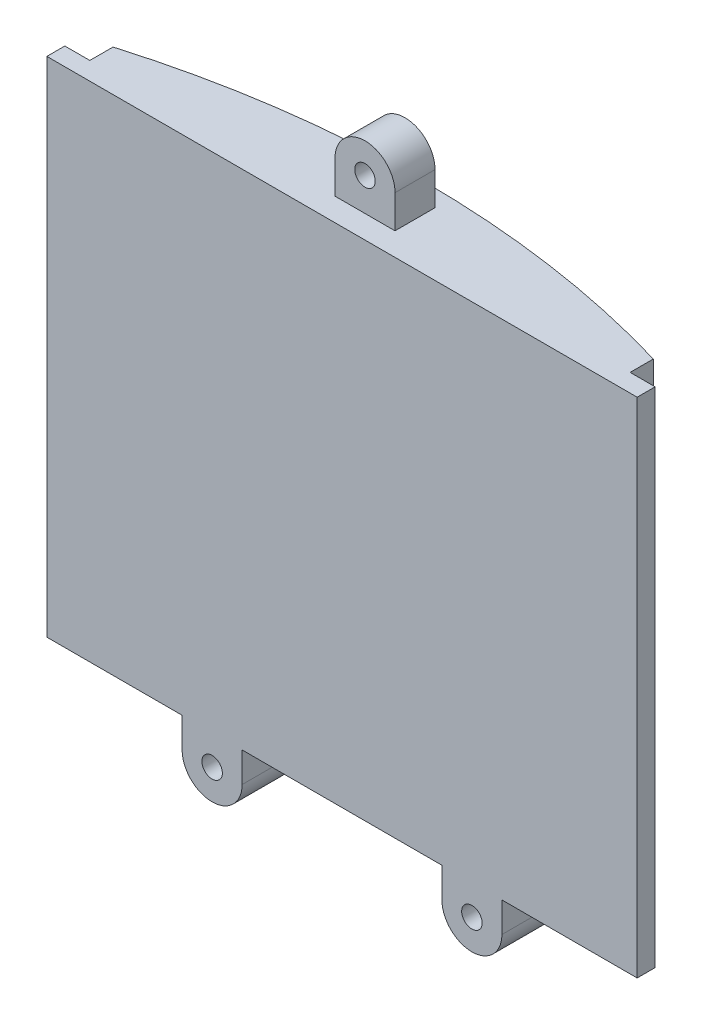
ISO-10303-21;
HEADER;
FILE_DESCRIPTION(('STEP AP214'),'2;1');
FILE_NAME('part.step','',(''),(''),'','','');
FILE_SCHEMA(('AUTOMOTIVE_DESIGN { 1 0 10303 214 1 1 1 1 }'));
ENDSEC;
DATA;
#1=APPLICATION_CONTEXT('core data for automotive mechanical design processes');
#2=APPLICATION_PROTOCOL_DEFINITION('international standard','automotive_design',2000,#1);
#3=PRODUCT_CONTEXT('',#1,'mechanical');
#4=PRODUCT('Part','Part','',(#3));
#5=PRODUCT_RELATED_PRODUCT_CATEGORY('part','',(#4));
#6=PRODUCT_DEFINITION_FORMATION('','',#4);
#7=PRODUCT_DEFINITION_CONTEXT('part definition',#1,'design');
#8=PRODUCT_DEFINITION('design','',#6,#7);
#9=PRODUCT_DEFINITION_SHAPE('','',#8);
#10=(LENGTH_UNIT() NAMED_UNIT(*) SI_UNIT(.MILLI.,.METRE.));
#11=(NAMED_UNIT(*) PLANE_ANGLE_UNIT() SI_UNIT($,.RADIAN.));
#12=(NAMED_UNIT(*) SI_UNIT($,.STERADIAN.) SOLID_ANGLE_UNIT());
#13=UNCERTAINTY_MEASURE_WITH_UNIT(LENGTH_MEASURE(1.E-05),#10,'distance_accuracy_value','');
#14=(GEOMETRIC_REPRESENTATION_CONTEXT(3) GLOBAL_UNCERTAINTY_ASSIGNED_CONTEXT((#13)) GLOBAL_UNIT_ASSIGNED_CONTEXT((#10,
#11,#12)) REPRESENTATION_CONTEXT('',''));
#15=CARTESIAN_POINT('',(0.,0.,0.));
#16=DIRECTION('',(0.,0.,1.));
#17=DIRECTION('',(1.,0.,0.));
#18=AXIS2_PLACEMENT_3D('',#15,#16,#17);
#19=CARTESIAN_POINT('',(0.,-40.9446130729417,50.1876320685335));
#20=DIRECTION('',(0.,-1.,0.));
#21=DIRECTION('',(0.,0.,-1.));
#22=AXIS2_PLACEMENT_3D('',#19,#20,#21);
#23=PLANE('',#22);
#24=DIRECTION('',(-1.,0.,0.));
#25=VECTOR('',#24,1.);
#26=CARTESIAN_POINT('',(-29.5149761749015,-40.9446130729417,-37.4));
#27=LINE('',#26,#25);
#28=CARTESIAN_POINT('',(29.5149761749015,-40.9446130729417,-37.4));
#29=VERTEX_POINT('',#28);
#30=CARTESIAN_POINT('',(15.9891024077721,-40.9446130729417,-37.4));
#31=VERTEX_POINT('',#30);
#32=EDGE_CURVE('E285',#29,#31,#27,.T.);
#33=ORIENTED_EDGE('',*,*,#32,.T.);
#34=DIRECTION('',(0.,0.,1.));
#35=VECTOR('',#34,1.);
#36=CARTESIAN_POINT('',(15.9891024077721,-40.9446130729417,-42.3));
#37=LINE('',#36,#35);
#38=CARTESIAN_POINT('',(15.9891024077721,-40.9446130729417,-42.3));
#39=VERTEX_POINT('',#38);
#40=EDGE_CURVE('E69',#39,#31,#37,.T.);
#41=ORIENTED_EDGE('',*,*,#40,.F.);
#42=DIRECTION('',(-1.,0.,0.));
#43=VECTOR('',#42,1.);
#44=CARTESIAN_POINT('',(0.,-40.9446130729418,-42.3));
#45=LINE('',#44,#43);
#46=CARTESIAN_POINT('',(9.98910240777212,-40.9446130729417,-42.3));
#47=VERTEX_POINT('',#46);
#48=EDGE_CURVE('E224',#39,#47,#45,.T.);
#49=ORIENTED_EDGE('',*,*,#48,.T.);
#50=DIRECTION('',(0.,0.,1.));
#51=VECTOR('',#50,1.);
#52=CARTESIAN_POINT('',(9.98910240777212,-40.9446130729417,-42.3));
#53=LINE('',#52,#51);
#54=CARTESIAN_POINT('',(9.98910240777212,-40.9446130729417,-37.4));
#55=VERTEX_POINT('',#54);
#56=EDGE_CURVE('E216',#47,#55,#53,.T.);
#57=ORIENTED_EDGE('',*,*,#56,.T.);
#58=CARTESIAN_POINT('',(-9.98910240777212,-40.9446130729417,-37.4));
#59=VERTEX_POINT('',#58);
#60=EDGE_CURVE('E287',#55,#59,#27,.T.);
#61=ORIENTED_EDGE('',*,*,#60,.T.);
#62=DIRECTION('',(0.,0.,1.));
#63=VECTOR('',#62,1.);
#64=CARTESIAN_POINT('',(-9.98910240777212,-40.9446130729417,-42.3));
#65=LINE('',#64,#63);
#66=CARTESIAN_POINT('',(-9.98910240777212,-40.9446130729417,-42.3));
#67=VERTEX_POINT('',#66);
#68=EDGE_CURVE('E259',#67,#59,#65,.T.);
#69=ORIENTED_EDGE('',*,*,#68,.F.);
#70=DIRECTION('',(-1.,0.,0.));
#71=VECTOR('',#70,1.);
#72=CARTESIAN_POINT('',(0.,-40.9446130729417,-42.3));
#73=LINE('',#72,#71);
#74=CARTESIAN_POINT('',(-15.9891024077721,-40.9446130729417,-42.3));
#75=VERTEX_POINT('',#74);
#76=EDGE_CURVE('E236',#67,#75,#73,.T.);
#77=ORIENTED_EDGE('',*,*,#76,.T.);
#78=DIRECTION('',(0.,0.,1.));
#79=VECTOR('',#78,1.);
#80=CARTESIAN_POINT('',(-15.9891024077721,-40.9446130729417,-42.3));
#81=LINE('',#80,#79);
#82=CARTESIAN_POINT('',(-15.9891024077721,-40.9446130729417,-37.4));
#83=VERTEX_POINT('',#82);
#84=EDGE_CURVE('E246',#75,#83,#81,.T.);
#85=ORIENTED_EDGE('',*,*,#84,.T.);
#86=CARTESIAN_POINT('',(-29.5149761749015,-40.9446130729417,-37.4));
#87=VERTEX_POINT('',#86);
#88=EDGE_CURVE('E262',#83,#87,#27,.T.);
#89=ORIENTED_EDGE('',*,*,#88,.T.);
#90=DIRECTION('',(0.,0.,-1.));
#91=VECTOR('',#90,1.);
#92=CARTESIAN_POINT('',(-29.5149761749015,-40.9446130729417,-37.4));
#93=LINE('',#92,#91);
#94=CARTESIAN_POINT('',(-29.5149761749015,-40.9446130729417,-39.1966199322564));
#95=VERTEX_POINT('',#94);
#96=EDGE_CURVE('E282',#87,#95,#93,.T.);
#97=ORIENTED_EDGE('',*,*,#96,.T.);
#98=DIRECTION('',(1.,0.,0.));
#99=VECTOR('',#98,1.);
#100=CARTESIAN_POINT('',(-29.5149761749015,-40.9446130729417,-39.1966199322564));
#101=LINE('',#100,#99);
#102=CARTESIAN_POINT('',(-27.0149761749015,-40.9446130729417,-39.1966199322564));
#103=VERTEX_POINT('',#102);
#104=EDGE_CURVE('E279',#95,#103,#101,.T.);
#105=ORIENTED_EDGE('',*,*,#104,.T.);
#106=DIRECTION('',(0.,0.,-1.));
#107=VECTOR('',#106,1.);
#108=CARTESIAN_POINT('',(-27.0149761749015,-40.9446130729417,-39.1966199322564));
#109=LINE('',#108,#107);
#110=CARTESIAN_POINT('',(-27.0149761749015,-40.9446130729417,-41.5179745823137));
#111=VERTEX_POINT('',#110);
#112=EDGE_CURVE('E276',#103,#111,#109,.T.);
#113=ORIENTED_EDGE('',*,*,#112,.T.);
#114=CARTESIAN_POINT('',(0.,-40.9446130729417,50.1876320685335));
#115=DIRECTION('',(0.,-1.,0.));
#116=DIRECTION('',(0.,0.,-1.));
#117=AXIS2_PLACEMENT_3D('',#114,#115,#116);
#118=CIRCLE('',#117,95.6019206341086);
#119=CARTESIAN_POINT('',(27.0149761749016,-40.9446130729417,-41.5179745823136));
#120=VERTEX_POINT('',#119);
#121=EDGE_CURVE('E273',#111,#120,#118,.T.);
#122=ORIENTED_EDGE('',*,*,#121,.T.);
#123=DIRECTION('',(0.,0.,1.));
#124=VECTOR('',#123,1.);
#125=CARTESIAN_POINT('',(27.0149761749015,-40.9446130729417,-39.1966199322563));
#126=LINE('',#125,#124);
#127=CARTESIAN_POINT('',(27.0149761749015,-40.9446130729417,-39.1966199322563));
#128=VERTEX_POINT('',#127);
#129=EDGE_CURVE('E270',#120,#128,#126,.T.);
#130=ORIENTED_EDGE('',*,*,#129,.T.);
#131=DIRECTION('',(1.,0.,0.));
#132=VECTOR('',#131,1.);
#133=CARTESIAN_POINT('',(29.5149761749015,-40.9446130729417,-39.1966199322563));
#134=LINE('',#133,#132);
#135=CARTESIAN_POINT('',(29.5149761749015,-40.9446130729417,-39.1966199322563));
#136=VERTEX_POINT('',#135);
#137=EDGE_CURVE('E267',#128,#136,#134,.T.);
#138=ORIENTED_EDGE('',*,*,#137,.T.);
#139=DIRECTION('',(0.,0.,1.));
#140=VECTOR('',#139,1.);
#141=CARTESIAN_POINT('',(29.5149761749015,-40.9446130729417,-37.4));
#142=LINE('',#141,#140);
#143=EDGE_CURVE('E263',#136,#29,#142,.T.);
#144=ORIENTED_EDGE('',*,*,#143,.T.);
#145=EDGE_LOOP('',(#33,#41,#49,#57,#61,#69,#77,#85,#89,#97,#105,#113,#122,#130,#138,#144));
#146=FACE_BOUND('',#145,.T.);
#147=ADVANCED_FACE('F44',(#146),#23,.T.);
#148=CARTESIAN_POINT('',(0.,9.35538692705828,-27.));
#149=DIRECTION('',(0.,1.,0.));
#150=DIRECTION('',(0.,0.,1.));
#151=AXIS2_PLACEMENT_3D('',#148,#149,#150);
#152=PLANE('',#151);
#153=DIRECTION('',(-1.,0.,0.));
#154=VECTOR('',#153,1.);
#155=CARTESIAN_POINT('',(0.,9.35538692705828,-43.7));
#156=LINE('',#155,#154);
#157=CARTESIAN_POINT('',(3.,9.35538692705828,-43.7));
#158=VERTEX_POINT('',#157);
#159=CARTESIAN_POINT('',(-3.,9.35538692705828,-43.7));
#160=VERTEX_POINT('',#159);
#161=EDGE_CURVE('E11',#158,#160,#156,.T.);
#162=ORIENTED_EDGE('',*,*,#161,.F.);
#163=DIRECTION('',(0.,0.,1.));
#164=VECTOR('',#163,1.);
#165=CARTESIAN_POINT('',(3.,9.35538692705828,-27.));
#166=LINE('',#165,#164);
#167=CARTESIAN_POINT('',(3.,9.35538692705828,-39.7));
#168=VERTEX_POINT('',#167);
#169=EDGE_CURVE('E53',#158,#168,#166,.T.);
#170=ORIENTED_EDGE('',*,*,#169,.T.);
#171=DIRECTION('',(-1.,0.,0.));
#172=VECTOR('',#171,1.);
#173=CARTESIAN_POINT('',(0.,9.35538692705828,-39.7));
#174=LINE('',#173,#172);
#175=CARTESIAN_POINT('',(-3.,9.35538692705828,-39.7));
#176=VERTEX_POINT('',#175);
#177=EDGE_CURVE('E328',#168,#176,#174,.T.);
#178=ORIENTED_EDGE('',*,*,#177,.T.);
#179=DIRECTION('',(0.,0.,-1.));
#180=VECTOR('',#179,1.);
#181=CARTESIAN_POINT('',(-3.,9.35538692705828,-27.));
#182=LINE('',#181,#180);
#183=EDGE_CURVE('E331',#176,#160,#182,.T.);
#184=ORIENTED_EDGE('',*,*,#183,.T.);
#185=EDGE_LOOP('',(#162,#170,#178,#184));
#186=FACE_BOUND('',#185,.T.);
#187=DIRECTION('',(-1.,0.,0.));
#188=VECTOR('',#187,1.);
#189=CARTESIAN_POINT('',(-29.5149761749015,9.35538692705828,-37.4));
#190=LINE('',#189,#188);
#191=CARTESIAN_POINT('',(29.5149761749015,9.35538692705828,-37.4));
#192=VERTEX_POINT('',#191);
#193=CARTESIAN_POINT('',(-29.5149761749015,9.35538692705828,-37.4));
#194=VERTEX_POINT('',#193);
#195=EDGE_CURVE('E291',#192,#194,#190,.T.);
#196=ORIENTED_EDGE('',*,*,#195,.F.);
#197=DIRECTION('',(0.,0.,1.));
#198=VECTOR('',#197,1.);
#199=CARTESIAN_POINT('',(29.5149761749015,9.35538692705828,-37.4));
#200=LINE('',#199,#198);
#201=CARTESIAN_POINT('',(29.5149761749015,9.35538692705828,-39.1966199322563));
#202=VERTEX_POINT('',#201);
#203=EDGE_CURVE('E296',#202,#192,#200,.T.);
#204=ORIENTED_EDGE('',*,*,#203,.F.);
#205=DIRECTION('',(1.,0.,0.));
#206=VECTOR('',#205,1.);
#207=CARTESIAN_POINT('',(29.5149761749015,9.35538692705828,-39.1966199322563));
#208=LINE('',#207,#206);
#209=CARTESIAN_POINT('',(27.0149761749015,9.35538692705828,-39.1966199322563));
#210=VERTEX_POINT('',#209);
#211=EDGE_CURVE('E300',#210,#202,#208,.T.);
#212=ORIENTED_EDGE('',*,*,#211,.F.);
#213=DIRECTION('',(0.,0.,1.));
#214=VECTOR('',#213,1.);
#215=CARTESIAN_POINT('',(27.0149761749015,9.35538692705828,-39.1966199322563));
#216=LINE('',#215,#214);
#217=CARTESIAN_POINT('',(27.0149761749016,9.35538692705828,-41.5179745823136));
#218=VERTEX_POINT('',#217);
#219=EDGE_CURVE('E304',#218,#210,#216,.T.);
#220=ORIENTED_EDGE('',*,*,#219,.F.);
#221=CARTESIAN_POINT('',(0.,9.35538692705828,50.1876320685335));
#222=DIRECTION('',(0.,1.,0.));
#223=DIRECTION('',(0.,0.,1.));
#224=AXIS2_PLACEMENT_3D('',#221,#222,#223);
#225=CIRCLE('',#224,95.6019206341086);
#226=CARTESIAN_POINT('',(-27.0149761749015,9.35538692705828,-41.5179745823137));
#227=VERTEX_POINT('',#226);
#228=EDGE_CURVE('E308',#227,#218,#225,.F.);
#229=ORIENTED_EDGE('',*,*,#228,.F.);
#230=DIRECTION('',(0.,0.,-1.));
#231=VECTOR('',#230,1.);
#232=CARTESIAN_POINT('',(-27.0149761749015,9.35538692705828,-39.1966199322564));
#233=LINE('',#232,#231);
#234=CARTESIAN_POINT('',(-27.0149761749015,9.35538692705828,-39.1966199322564));
#235=VERTEX_POINT('',#234);
#236=EDGE_CURVE('E312',#235,#227,#233,.T.);
#237=ORIENTED_EDGE('',*,*,#236,.F.);
#238=DIRECTION('',(1.,0.,0.));
#239=VECTOR('',#238,1.);
#240=CARTESIAN_POINT('',(-29.5149761749015,9.35538692705828,-39.1966199322564));
#241=LINE('',#240,#239);
#242=CARTESIAN_POINT('',(-29.5149761749015,9.35538692705828,-39.1966199322564));
#243=VERTEX_POINT('',#242);
#244=EDGE_CURVE('E316',#243,#235,#241,.T.);
#245=ORIENTED_EDGE('',*,*,#244,.F.);
#246=DIRECTION('',(0.,0.,-1.));
#247=VECTOR('',#246,1.);
#248=CARTESIAN_POINT('',(-29.5149761749015,9.35538692705828,-37.4));
#249=LINE('',#248,#247);
#250=EDGE_CURVE('E266',#194,#243,#249,.T.);
#251=ORIENTED_EDGE('',*,*,#250,.F.);
#252=EDGE_LOOP('',(#196,#204,#212,#220,#229,#237,#245,#251));
#253=FACE_BOUND('',#252,.T.);
#254=ADVANCED_FACE('F46',(#186,#253),#152,.T.);
#255=CARTESIAN_POINT('',(-29.5149761749015,69.2268909842191,-37.4));
#256=DIRECTION('',(-1.,0.,0.));
#257=DIRECTION('',(0.,0.,1.));
#258=AXIS2_PLACEMENT_3D('',#255,#256,#257);
#259=PLANE('',#258);
#260=DIRECTION('',(0.,-1.,0.));
#261=VECTOR('',#260,1.);
#262=CARTESIAN_POINT('',(-29.5149761749015,69.2268909842191,-37.4));
#263=LINE('',#262,#261);
#264=EDGE_CURVE('E294',#194,#87,#263,.T.);
#265=ORIENTED_EDGE('',*,*,#264,.F.);
#266=ORIENTED_EDGE('',*,*,#250,.T.);
#267=DIRECTION('',(0.,-1.,0.));
#268=VECTOR('',#267,1.);
#269=CARTESIAN_POINT('',(-29.5149761749015,69.2268909842191,-39.1966199322564));
#270=LINE('',#269,#268);
#271=EDGE_CURVE('E290',#243,#95,#270,.T.);
#272=ORIENTED_EDGE('',*,*,#271,.T.);
#273=ORIENTED_EDGE('',*,*,#96,.F.);
#274=EDGE_LOOP('',(#265,#266,#272,#273));
#275=FACE_BOUND('',#274,.T.);
#276=ADVANCED_FACE('F380',(#275),#259,.T.);
#277=CARTESIAN_POINT('',(-29.5149761749015,69.2268909842191,-39.1966199322564));
#278=DIRECTION('',(0.,0.,-1.));
#279=DIRECTION('',(-1.,0.,0.));
#280=AXIS2_PLACEMENT_3D('',#277,#278,#279);
#281=PLANE('',#280);
#282=ORIENTED_EDGE('',*,*,#271,.F.);
#283=ORIENTED_EDGE('',*,*,#244,.T.);
#284=DIRECTION('',(0.,-1.,0.));
#285=VECTOR('',#284,1.);
#286=CARTESIAN_POINT('',(-27.0149761749015,69.2268909842191,-39.1966199322564));
#287=LINE('',#286,#285);
#288=EDGE_CURVE('E315',#235,#103,#287,.T.);
#289=ORIENTED_EDGE('',*,*,#288,.T.);
#290=ORIENTED_EDGE('',*,*,#104,.F.);
#291=EDGE_LOOP('',(#282,#283,#289,#290));
#292=FACE_BOUND('',#291,.T.);
#293=ADVANCED_FACE('F410',(#292),#281,.T.);
#294=CARTESIAN_POINT('',(-27.0149761749015,69.2268909842191,-39.1966199322564));
#295=DIRECTION('',(-1.,0.,0.));
#296=DIRECTION('',(0.,0.,1.));
#297=AXIS2_PLACEMENT_3D('',#294,#295,#296);
#298=PLANE('',#297);
#299=ORIENTED_EDGE('',*,*,#288,.F.);
#300=ORIENTED_EDGE('',*,*,#236,.T.);
#301=DIRECTION('',(0.,-1.,0.));
#302=VECTOR('',#301,1.);
#303=CARTESIAN_POINT('',(-27.0149761749015,69.2268909842191,-41.5179745823137));
#304=LINE('',#303,#302);
#305=EDGE_CURVE('E311',#227,#111,#304,.T.);
#306=ORIENTED_EDGE('',*,*,#305,.T.);
#307=ORIENTED_EDGE('',*,*,#112,.F.);
#308=EDGE_LOOP('',(#299,#300,#306,#307));
#309=FACE_BOUND('',#308,.T.);
#310=ADVANCED_FACE('F406',(#309),#298,.T.);
#311=CARTESIAN_POINT('',(0.,69.2268909842191,50.1876320685335));
#312=DIRECTION('',(0.,-1.,0.));
#313=DIRECTION('',(0.,0.,-1.));
#314=AXIS2_PLACEMENT_3D('',#311,#312,#313);
#315=CYLINDRICAL_SURFACE('',#314,95.6019206341086);
#316=ORIENTED_EDGE('',*,*,#305,.F.);
#317=ORIENTED_EDGE('',*,*,#228,.T.);
#318=DIRECTION('',(0.,-1.,0.));
#319=VECTOR('',#318,1.);
#320=CARTESIAN_POINT('',(27.0149761749016,69.2268909842191,-41.5179745823136));
#321=LINE('',#320,#319);
#322=EDGE_CURVE('E307',#218,#120,#321,.T.);
#323=ORIENTED_EDGE('',*,*,#322,.T.);
#324=ORIENTED_EDGE('',*,*,#121,.F.);
#325=EDGE_LOOP('',(#316,#317,#323,#324));
#326=FACE_BOUND('',#325,.T.);
#327=ADVANCED_FACE('F402',(#326),#315,.T.);
#328=CARTESIAN_POINT('',(27.0149761749015,69.2268909842191,-39.1966199322563));
#329=DIRECTION('',(1.,0.,0.));
#330=DIRECTION('',(0.,0.,-1.));
#331=AXIS2_PLACEMENT_3D('',#328,#329,#330);
#332=PLANE('',#331);
#333=ORIENTED_EDGE('',*,*,#322,.F.);
#334=ORIENTED_EDGE('',*,*,#219,.T.);
#335=DIRECTION('',(0.,-1.,0.));
#336=VECTOR('',#335,1.);
#337=CARTESIAN_POINT('',(27.0149761749015,69.2268909842191,-39.1966199322563));
#338=LINE('',#337,#336);
#339=EDGE_CURVE('E303',#210,#128,#338,.T.);
#340=ORIENTED_EDGE('',*,*,#339,.T.);
#341=ORIENTED_EDGE('',*,*,#129,.F.);
#342=EDGE_LOOP('',(#333,#334,#340,#341));
#343=FACE_BOUND('',#342,.T.);
#344=ADVANCED_FACE('F399',(#343),#332,.T.);
#345=CARTESIAN_POINT('',(29.5149761749015,69.2268909842191,-39.1966199322563));
#346=DIRECTION('',(0.,0.,-1.));
#347=DIRECTION('',(-1.,0.,0.));
#348=AXIS2_PLACEMENT_3D('',#345,#346,#347);
#349=PLANE('',#348);
#350=ORIENTED_EDGE('',*,*,#339,.F.);
#351=ORIENTED_EDGE('',*,*,#211,.T.);
#352=DIRECTION('',(0.,-1.,0.));
#353=VECTOR('',#352,1.);
#354=CARTESIAN_POINT('',(29.5149761749015,69.2268909842191,-39.1966199322563));
#355=LINE('',#354,#353);
#356=EDGE_CURVE('E299',#202,#136,#355,.T.);
#357=ORIENTED_EDGE('',*,*,#356,.T.);
#358=ORIENTED_EDGE('',*,*,#137,.F.);
#359=EDGE_LOOP('',(#350,#351,#357,#358));
#360=FACE_BOUND('',#359,.T.);
#361=ADVANCED_FACE('F394',(#360),#349,.T.);
#362=CARTESIAN_POINT('',(29.5149761749015,69.2268909842191,-37.4));
#363=DIRECTION('',(1.,0.,0.));
#364=DIRECTION('',(0.,0.,-1.));
#365=AXIS2_PLACEMENT_3D('',#362,#363,#364);
#366=PLANE('',#365);
#367=ORIENTED_EDGE('',*,*,#356,.F.);
#368=ORIENTED_EDGE('',*,*,#203,.T.);
#369=DIRECTION('',(0.,-1.,0.));
#370=VECTOR('',#369,1.);
#371=CARTESIAN_POINT('',(29.5149761749015,69.2268909842191,-37.4));
#372=LINE('',#371,#370);
#373=EDGE_CURVE('E295',#192,#29,#372,.T.);
#374=ORIENTED_EDGE('',*,*,#373,.T.);
#375=ORIENTED_EDGE('',*,*,#143,.F.);
#376=EDGE_LOOP('',(#367,#368,#374,#375));
#377=FACE_BOUND('',#376,.T.);
#378=ADVANCED_FACE('F390',(#377),#366,.T.);
#379=CARTESIAN_POINT('',(-29.5149761749015,69.2268909842191,-37.4));
#380=DIRECTION('',(0.,0.,1.));
#381=DIRECTION('',(1.,0.,0.));
#382=AXIS2_PLACEMENT_3D('',#379,#380,#381);
#383=PLANE('',#382);
#384=CARTESIAN_POINT('',(-12.9891024077721,-43.9446130729417,-37.4));
#385=DIRECTION('',(0.,0.,1.));
#386=DIRECTION('',(1.,0.,0.));
#387=AXIS2_PLACEMENT_3D('',#384,#385,#386);
#388=CIRCLE('',#387,1.02499999999999);
#389=CARTESIAN_POINT('',(-11.9641024077721,-43.9446130729417,-37.4));
#390=VERTEX_POINT('',#389);
#391=EDGE_CURVE('E48',#390,#390,#388,.T.);
#392=ORIENTED_EDGE('',*,*,#391,.F.);
#393=EDGE_LOOP('',(#392));
#394=FACE_BOUND('',#393,.T.);
#395=CARTESIAN_POINT('',(12.9891024077721,-43.9446130729417,-37.4));
#396=DIRECTION('',(0.,0.,1.));
#397=DIRECTION('',(1.,0.,0.));
#398=AXIS2_PLACEMENT_3D('',#395,#396,#397);
#399=CIRCLE('',#398,1.02499999999999);
#400=CARTESIAN_POINT('',(14.0141024077721,-43.9446130729417,-37.4));
#401=VERTEX_POINT('',#400);
#402=EDGE_CURVE('E334',#401,#401,#399,.T.);
#403=ORIENTED_EDGE('',*,*,#402,.F.);
#404=EDGE_LOOP('',(#403));
#405=FACE_BOUND('',#404,.T.);
#406=ORIENTED_EDGE('',*,*,#373,.F.);
#407=ORIENTED_EDGE('',*,*,#195,.T.);
#408=ORIENTED_EDGE('',*,*,#264,.T.);
#409=ORIENTED_EDGE('',*,*,#88,.F.);
#410=DIRECTION('',(0.,1.,0.));
#411=VECTOR('',#410,1.);
#412=CARTESIAN_POINT('',(-15.9891024077721,0.,-37.4));
#413=LINE('',#412,#411);
#414=CARTESIAN_POINT('',(-15.9891024077721,-43.9446130729417,-37.4));
#415=VERTEX_POINT('',#414);
#416=EDGE_CURVE('E240',#415,#83,#413,.T.);
#417=ORIENTED_EDGE('',*,*,#416,.F.);
#418=CARTESIAN_POINT('',(-12.9891024077721,-43.9446130729417,-37.4));
#419=DIRECTION('',(0.,0.,-1.));
#420=DIRECTION('',(-1.,0.,0.));
#421=AXIS2_PLACEMENT_3D('',#418,#419,#420);
#422=CIRCLE('',#421,3.);
#423=CARTESIAN_POINT('',(-9.98910240777212,-43.9446130729417,-37.4));
#424=VERTEX_POINT('',#423);
#425=EDGE_CURVE('E248',#424,#415,#422,.T.);
#426=ORIENTED_EDGE('',*,*,#425,.F.);
#427=DIRECTION('',(0.,-1.,0.));
#428=VECTOR('',#427,1.);
#429=CARTESIAN_POINT('',(-9.98910240777217,0.,-37.4));
#430=LINE('',#429,#428);
#431=EDGE_CURVE('E228',#59,#424,#430,.T.);
#432=ORIENTED_EDGE('',*,*,#431,.F.);
#433=ORIENTED_EDGE('',*,*,#60,.F.);
#434=DIRECTION('',(0.,1.,0.));
#435=VECTOR('',#434,1.);
#436=CARTESIAN_POINT('',(9.98910240777217,0.,-37.4));
#437=LINE('',#436,#435);
#438=CARTESIAN_POINT('',(9.98910240777212,-43.9446130729417,-37.4));
#439=VERTEX_POINT('',#438);
#440=EDGE_CURVE('E220',#439,#55,#437,.T.);
#441=ORIENTED_EDGE('',*,*,#440,.F.);
#442=CARTESIAN_POINT('',(12.9891024077721,-43.9446130729417,-37.4));
#443=DIRECTION('',(0.,0.,-1.));
#444=DIRECTION('',(-1.,0.,0.));
#445=AXIS2_PLACEMENT_3D('',#442,#443,#444);
#446=CIRCLE('',#445,3.);
#447=CARTESIAN_POINT('',(15.9891024077721,-43.9446130729417,-37.4));
#448=VERTEX_POINT('',#447);
#449=EDGE_CURVE('E223',#448,#439,#446,.T.);
#450=ORIENTED_EDGE('',*,*,#449,.F.);
#451=DIRECTION('',(0.,-1.,0.));
#452=VECTOR('',#451,1.);
#453=CARTESIAN_POINT('',(15.9891024077721,0.,-37.4));
#454=LINE('',#453,#452);
#455=EDGE_CURVE('E226',#31,#448,#454,.T.);
#456=ORIENTED_EDGE('',*,*,#455,.F.);
#457=ORIENTED_EDGE('',*,*,#32,.F.);
#458=EDGE_LOOP('',(#406,#407,#408,#409,#417,#426,#432,#433,#441,#450,#456,#457));
#459=FACE_BOUND('',#458,.T.);
#460=ADVANCED_FACE('F386',(#394,#405,#459),#383,.T.);
#461=CARTESIAN_POINT('',(-9.98910240777217,0.,-42.3));
#462=DIRECTION('',(-1.,0.,0.));
#463=DIRECTION('',(0.,-1.,0.));
#464=AXIS2_PLACEMENT_3D('',#461,#462,#463);
#465=PLANE('',#464);
#466=ORIENTED_EDGE('',*,*,#431,.T.);
#467=DIRECTION('',(0.,0.,1.));
#468=VECTOR('',#467,1.);
#469=CARTESIAN_POINT('',(-9.98910240777212,-43.9446130729417,-42.3));
#470=LINE('',#469,#468);
#471=CARTESIAN_POINT('',(-9.98910240777212,-43.9446130729417,-42.3));
#472=VERTEX_POINT('',#471);
#473=EDGE_CURVE('E256',#472,#424,#470,.T.);
#474=ORIENTED_EDGE('',*,*,#473,.F.);
#475=DIRECTION('',(0.,-1.,0.));
#476=VECTOR('',#475,1.);
#477=CARTESIAN_POINT('',(-9.98910240777217,0.,-42.3));
#478=LINE('',#477,#476);
#479=EDGE_CURVE('E239',#67,#472,#478,.T.);
#480=ORIENTED_EDGE('',*,*,#479,.F.);
#481=ORIENTED_EDGE('',*,*,#68,.T.);
#482=EDGE_LOOP('',(#466,#474,#480,#481));
#483=FACE_BOUND('',#482,.T.);
#484=ADVANCED_FACE('F421',(#483),#465,.F.);
#485=CARTESIAN_POINT('',(-12.9891024077721,-43.9446130729417,-42.3));
#486=DIRECTION('',(0.,0.,1.));
#487=DIRECTION('',(1.,0.,0.));
#488=AXIS2_PLACEMENT_3D('',#485,#486,#487);
#489=CYLINDRICAL_SURFACE('',#488,3.);
#490=ORIENTED_EDGE('',*,*,#425,.T.);
#491=DIRECTION('',(0.,0.,1.));
#492=VECTOR('',#491,1.);
#493=CARTESIAN_POINT('',(-15.9891024077721,-43.9446130729417,-42.3));
#494=LINE('',#493,#492);
#495=CARTESIAN_POINT('',(-15.9891024077721,-43.9446130729417,-42.3));
#496=VERTEX_POINT('',#495);
#497=EDGE_CURVE('E253',#496,#415,#494,.T.);
#498=ORIENTED_EDGE('',*,*,#497,.F.);
#499=CARTESIAN_POINT('',(-12.9891024077721,-43.9446130729417,-42.3));
#500=DIRECTION('',(0.,0.,-1.));
#501=DIRECTION('',(-1.,0.,0.));
#502=AXIS2_PLACEMENT_3D('',#499,#500,#501);
#503=CIRCLE('',#502,3.);
#504=EDGE_CURVE('E242',#472,#496,#503,.T.);
#505=ORIENTED_EDGE('',*,*,#504,.F.);
#506=ORIENTED_EDGE('',*,*,#473,.T.);
#507=EDGE_LOOP('',(#490,#498,#505,#506));
#508=FACE_BOUND('',#507,.T.);
#509=ADVANCED_FACE('F426',(#508),#489,.T.);
#510=CARTESIAN_POINT('',(-15.9891024077721,0.,-42.3));
#511=DIRECTION('',(1.,0.,0.));
#512=DIRECTION('',(0.,0.,-1.));
#513=AXIS2_PLACEMENT_3D('',#510,#511,#512);
#514=PLANE('',#513);
#515=ORIENTED_EDGE('',*,*,#416,.T.);
#516=ORIENTED_EDGE('',*,*,#84,.F.);
#517=DIRECTION('',(0.,1.,0.));
#518=VECTOR('',#517,1.);
#519=CARTESIAN_POINT('',(-15.9891024077721,0.,-42.3));
#520=LINE('',#519,#518);
#521=EDGE_CURVE('E244',#496,#75,#520,.T.);
#522=ORIENTED_EDGE('',*,*,#521,.F.);
#523=ORIENTED_EDGE('',*,*,#497,.T.);
#524=EDGE_LOOP('',(#515,#516,#522,#523));
#525=FACE_BOUND('',#524,.T.);
#526=ADVANCED_FACE('F430',(#525),#514,.F.);
#527=CARTESIAN_POINT('',(0.,0.,-42.3));
#528=DIRECTION('',(0.,0.,-1.));
#529=DIRECTION('',(-1.,0.,0.));
#530=AXIS2_PLACEMENT_3D('',#527,#528,#529);
#531=PLANE('',#530);
#532=CARTESIAN_POINT('',(-12.9891024077721,-43.9446130729417,-42.3));
#533=DIRECTION('',(0.,0.,-1.));
#534=DIRECTION('',(-1.,0.,0.));
#535=AXIS2_PLACEMENT_3D('',#532,#533,#534);
#536=CIRCLE('',#535,2.5);
#537=CARTESIAN_POINT('',(-15.4891024077721,-43.9446130729417,-42.3));
#538=VERTEX_POINT('',#537);
#539=EDGE_CURVE('E366',#538,#538,#536,.T.);
#540=ORIENTED_EDGE('',*,*,#539,.F.);
#541=EDGE_LOOP('',(#540));
#542=FACE_BOUND('',#541,.T.);
#543=ORIENTED_EDGE('',*,*,#76,.F.);
#544=ORIENTED_EDGE('',*,*,#479,.T.);
#545=ORIENTED_EDGE('',*,*,#504,.T.);
#546=ORIENTED_EDGE('',*,*,#521,.T.);
#547=EDGE_LOOP('',(#543,#544,#545,#546));
#548=FACE_BOUND('',#547,.T.);
#549=ADVANCED_FACE('F433',(#542,#548),#531,.T.);
#550=CARTESIAN_POINT('',(15.9891024077721,0.,-42.3));
#551=DIRECTION('',(-1.,0.,0.));
#552=DIRECTION('',(0.,0.,1.));
#553=AXIS2_PLACEMENT_3D('',#550,#551,#552);
#554=PLANE('',#553);
#555=ORIENTED_EDGE('',*,*,#455,.T.);
#556=DIRECTION('',(0.,0.,1.));
#557=VECTOR('',#556,1.);
#558=CARTESIAN_POINT('',(15.9891024077721,-43.9446130729417,-42.3));
#559=LINE('',#558,#557);
#560=CARTESIAN_POINT('',(15.9891024077721,-43.9446130729417,-42.3));
#561=VERTEX_POINT('',#560);
#562=EDGE_CURVE('E206',#561,#448,#559,.T.);
#563=ORIENTED_EDGE('',*,*,#562,.F.);
#564=DIRECTION('',(0.,-1.,0.));
#565=VECTOR('',#564,1.);
#566=CARTESIAN_POINT('',(15.9891024077721,0.,-42.3));
#567=LINE('',#566,#565);
#568=EDGE_CURVE('E233',#39,#561,#567,.T.);
#569=ORIENTED_EDGE('',*,*,#568,.F.);
#570=ORIENTED_EDGE('',*,*,#40,.T.);
#571=EDGE_LOOP('',(#555,#563,#569,#570));
#572=FACE_BOUND('',#571,.T.);
#573=ADVANCED_FACE('F435',(#572),#554,.F.);
#574=CARTESIAN_POINT('',(12.9891024077721,-43.9446130729417,-42.3));
#575=DIRECTION('',(0.,0.,1.));
#576=DIRECTION('',(1.,0.,0.));
#577=AXIS2_PLACEMENT_3D('',#574,#575,#576);
#578=CYLINDRICAL_SURFACE('',#577,3.);
#579=ORIENTED_EDGE('',*,*,#449,.T.);
#580=DIRECTION('',(0.,0.,1.));
#581=VECTOR('',#580,1.);
#582=CARTESIAN_POINT('',(9.98910240777212,-43.9446130729417,-42.3));
#583=LINE('',#582,#581);
#584=CARTESIAN_POINT('',(9.98910240777212,-43.9446130729417,-42.3));
#585=VERTEX_POINT('',#584);
#586=EDGE_CURVE('E213',#585,#439,#583,.T.);
#587=ORIENTED_EDGE('',*,*,#586,.F.);
#588=CARTESIAN_POINT('',(12.9891024077721,-43.9446130729417,-42.3));
#589=DIRECTION('',(0.,0.,-1.));
#590=DIRECTION('',(-1.,0.,0.));
#591=AXIS2_PLACEMENT_3D('',#588,#589,#590);
#592=CIRCLE('',#591,3.);
#593=EDGE_CURVE('E231',#561,#585,#592,.T.);
#594=ORIENTED_EDGE('',*,*,#593,.F.);
#595=ORIENTED_EDGE('',*,*,#562,.T.);
#596=EDGE_LOOP('',(#579,#587,#594,#595));
#597=FACE_BOUND('',#596,.T.);
#598=ADVANCED_FACE('F442',(#597),#578,.T.);
#599=CARTESIAN_POINT('',(9.98910240777217,0.,-42.3));
#600=DIRECTION('',(1.,0.,0.));
#601=DIRECTION('',(0.,1.,0.));
#602=AXIS2_PLACEMENT_3D('',#599,#600,#601);
#603=PLANE('',#602);
#604=ORIENTED_EDGE('',*,*,#440,.T.);
#605=ORIENTED_EDGE('',*,*,#56,.F.);
#606=DIRECTION('',(0.,1.,0.));
#607=VECTOR('',#606,1.);
#608=CARTESIAN_POINT('',(9.98910240777217,0.,-42.3));
#609=LINE('',#608,#607);
#610=EDGE_CURVE('E219',#585,#47,#609,.T.);
#611=ORIENTED_EDGE('',*,*,#610,.F.);
#612=ORIENTED_EDGE('',*,*,#586,.T.);
#613=EDGE_LOOP('',(#604,#605,#611,#612));
#614=FACE_BOUND('',#613,.T.);
#615=ADVANCED_FACE('F556',(#614),#603,.F.);
#616=CARTESIAN_POINT('',(0.,0.,-42.3));
#617=DIRECTION('',(0.,0.,-1.));
#618=DIRECTION('',(-1.,0.,0.));
#619=AXIS2_PLACEMENT_3D('',#616,#617,#618);
#620=PLANE('',#619);
#621=CARTESIAN_POINT('',(12.9891024077721,-43.9446130729417,-42.3));
#622=DIRECTION('',(0.,0.,-1.));
#623=DIRECTION('',(-1.,0.,0.));
#624=AXIS2_PLACEMENT_3D('',#621,#622,#623);
#625=CIRCLE('',#624,2.5);
#626=CARTESIAN_POINT('',(10.4891024077721,-43.9446130729417,-42.3));
#627=VERTEX_POINT('',#626);
#628=EDGE_CURVE('E363',#627,#627,#625,.T.);
#629=ORIENTED_EDGE('',*,*,#628,.F.);
#630=EDGE_LOOP('',(#629));
#631=FACE_BOUND('',#630,.T.);
#632=ORIENTED_EDGE('',*,*,#48,.F.);
#633=ORIENTED_EDGE('',*,*,#568,.T.);
#634=ORIENTED_EDGE('',*,*,#593,.T.);
#635=ORIENTED_EDGE('',*,*,#610,.T.);
#636=EDGE_LOOP('',(#632,#633,#634,#635));
#637=FACE_BOUND('',#636,.T.);
#638=ADVANCED_FACE('F577',(#631,#637),#620,.T.);
#639=CARTESIAN_POINT('',(0.,12.6553869270583,-43.7));
#640=DIRECTION('',(0.,0.,1.));
#641=DIRECTION('',(1.,0.,0.));
#642=AXIS2_PLACEMENT_3D('',#639,#640,#641);
#643=CYLINDRICAL_SURFACE('',#642,3.);
#644=CARTESIAN_POINT('',(0.,12.6553869270583,-39.7));
#645=DIRECTION('',(0.,0.,-1.));
#646=DIRECTION('',(-1.,0.,0.));
#647=AXIS2_PLACEMENT_3D('',#644,#645,#646);
#648=CIRCLE('',#647,3.);
#649=CARTESIAN_POINT('',(-3.,12.6553869270583,-39.7));
#650=VERTEX_POINT('',#649);
#651=CARTESIAN_POINT('',(3.,12.6553869270583,-39.7));
#652=VERTEX_POINT('',#651);
#653=EDGE_CURVE('E203',#650,#652,#648,.T.);
#654=ORIENTED_EDGE('',*,*,#653,.T.);
#655=DIRECTION('',(0.,0.,1.));
#656=VECTOR('',#655,1.);
#657=CARTESIAN_POINT('',(3.,12.6553869270583,-43.7));
#658=LINE('',#657,#656);
#659=CARTESIAN_POINT('',(3.,12.6553869270583,-43.7));
#660=VERTEX_POINT('',#659);
#661=EDGE_CURVE('E187',#660,#652,#658,.T.);
#662=ORIENTED_EDGE('',*,*,#661,.F.);
#663=CARTESIAN_POINT('',(0.,12.6553869270583,-43.7));
#664=DIRECTION('',(0.,0.,-1.));
#665=DIRECTION('',(-1.,0.,0.));
#666=AXIS2_PLACEMENT_3D('',#663,#664,#665);
#667=CIRCLE('',#666,3.);
#668=CARTESIAN_POINT('',(-3.,12.6553869270583,-43.7));
#669=VERTEX_POINT('',#668);
#670=EDGE_CURVE('E193',#669,#660,#667,.T.);
#671=ORIENTED_EDGE('',*,*,#670,.F.);
#672=DIRECTION('',(0.,0.,1.));
#673=VECTOR('',#672,1.);
#674=CARTESIAN_POINT('',(-3.,12.6553869270583,-43.7));
#675=LINE('',#674,#673);
#676=EDGE_CURVE('E204',#669,#650,#675,.T.);
#677=ORIENTED_EDGE('',*,*,#676,.T.);
#678=EDGE_LOOP('',(#654,#662,#671,#677));
#679=FACE_BOUND('',#678,.T.);
#680=ADVANCED_FACE('F202',(#679),#643,.T.);
#681=CARTESIAN_POINT('',(3.,9.35538692705828,-43.7));
#682=DIRECTION('',(-1.,0.,0.));
#683=DIRECTION('',(0.,0.,1.));
#684=AXIS2_PLACEMENT_3D('',#681,#682,#683);
#685=PLANE('',#684);
#686=ORIENTED_EDGE('',*,*,#169,.F.);
#687=DIRECTION('',(0.,-1.,0.));
#688=VECTOR('',#687,1.);
#689=CARTESIAN_POINT('',(3.,12.6553869270583,-43.7));
#690=LINE('',#689,#688);
#691=EDGE_CURVE('E182',#660,#158,#690,.T.);
#692=ORIENTED_EDGE('',*,*,#691,.F.);
#693=ORIENTED_EDGE('',*,*,#661,.T.);
#694=DIRECTION('',(0.,-1.,0.));
#695=VECTOR('',#694,1.);
#696=CARTESIAN_POINT('',(3.,9.35538692705828,-39.7));
#697=LINE('',#696,#695);
#698=EDGE_CURVE('E373',#652,#168,#697,.T.);
#699=ORIENTED_EDGE('',*,*,#698,.T.);
#700=EDGE_LOOP('',(#686,#692,#693,#699));
#701=FACE_BOUND('',#700,.T.);
#702=ADVANCED_FACE('F184',(#701),#685,.F.);
#703=CARTESIAN_POINT('',(-3.,9.35538692705828,-43.7));
#704=DIRECTION('',(1.,0.,0.));
#705=DIRECTION('',(0.,1.,0.));
#706=AXIS2_PLACEMENT_3D('',#703,#704,#705);
#707=PLANE('',#706);
#708=ORIENTED_EDGE('',*,*,#183,.F.);
#709=DIRECTION('',(0.,1.,0.));
#710=VECTOR('',#709,1.);
#711=CARTESIAN_POINT('',(-3.,9.35538692705828,-39.7));
#712=LINE('',#711,#710);
#713=EDGE_CURVE('E61',#176,#650,#712,.T.);
#714=ORIENTED_EDGE('',*,*,#713,.T.);
#715=ORIENTED_EDGE('',*,*,#676,.F.);
#716=DIRECTION('',(0.,1.,0.));
#717=VECTOR('',#716,1.);
#718=CARTESIAN_POINT('',(-3.,7.46259750665648,-43.7));
#719=LINE('',#718,#717);
#720=EDGE_CURVE('E192',#160,#669,#719,.T.);
#721=ORIENTED_EDGE('',*,*,#720,.F.);
#722=EDGE_LOOP('',(#708,#714,#715,#721));
#723=FACE_BOUND('',#722,.T.);
#724=ADVANCED_FACE('F375',(#723),#707,.F.);
#725=CARTESIAN_POINT('',(0.,12.6553869270583,-43.7));
#726=DIRECTION('',(0.,0.,-1.));
#727=DIRECTION('',(-1.,0.,0.));
#728=AXIS2_PLACEMENT_3D('',#725,#726,#727);
#729=PLANE('',#728);
#730=CARTESIAN_POINT('',(0.,12.6553869270583,-43.7));
#731=DIRECTION('',(0.,0.,-1.));
#732=DIRECTION('',(-1.,0.,0.));
#733=AXIS2_PLACEMENT_3D('',#730,#731,#732);
#734=CIRCLE('',#733,2.5);
#735=CARTESIAN_POINT('',(-2.5,12.6553869270583,-43.7));
#736=VERTEX_POINT('',#735);
#737=EDGE_CURVE('E353',#736,#736,#734,.T.);
#738=ORIENTED_EDGE('',*,*,#737,.F.);
#739=EDGE_LOOP('',(#738));
#740=FACE_BOUND('',#739,.T.);
#741=ORIENTED_EDGE('',*,*,#691,.T.);
#742=ORIENTED_EDGE('',*,*,#161,.T.);
#743=ORIENTED_EDGE('',*,*,#720,.T.);
#744=ORIENTED_EDGE('',*,*,#670,.T.);
#745=EDGE_LOOP('',(#741,#742,#743,#744));
#746=FACE_BOUND('',#745,.T.);
#747=ADVANCED_FACE('F196',(#740,#746),#729,.T.);
#748=CARTESIAN_POINT('',(0.,12.6553869270583,-39.7));
#749=DIRECTION('',(0.,0.,-1.));
#750=DIRECTION('',(-1.,0.,0.));
#751=AXIS2_PLACEMENT_3D('',#748,#749,#750);
#752=PLANE('',#751);
#753=CARTESIAN_POINT('',(0.,12.6553869270583,-39.7));
#754=DIRECTION('',(0.,0.,-1.));
#755=DIRECTION('',(-1.,0.,0.));
#756=AXIS2_PLACEMENT_3D('',#753,#754,#755);
#757=CIRCLE('',#756,1.02499999999999);
#758=CARTESIAN_POINT('',(-1.02499999999999,12.6553869270583,-39.7));
#759=VERTEX_POINT('',#758);
#760=EDGE_CURVE('E341',#759,#759,#757,.T.);
#761=ORIENTED_EDGE('',*,*,#760,.T.);
#762=EDGE_LOOP('',(#761));
#763=FACE_BOUND('',#762,.T.);
#764=ORIENTED_EDGE('',*,*,#177,.F.);
#765=ORIENTED_EDGE('',*,*,#698,.F.);
#766=ORIENTED_EDGE('',*,*,#653,.F.);
#767=ORIENTED_EDGE('',*,*,#713,.F.);
#768=EDGE_LOOP('',(#764,#765,#766,#767));
#769=FACE_BOUND('',#768,.T.);
#770=ADVANCED_FACE('F376',(#763,#769),#752,.F.);
#771=CARTESIAN_POINT('',(12.9891024077721,-43.9446130729417,-39.8));
#772=DIRECTION('',(0.,0.,-1.));
#773=DIRECTION('',(-1.,0.,0.));
#774=AXIS2_PLACEMENT_3D('',#771,#772,#773);
#775=CYLINDRICAL_SURFACE('',#774,2.5);
#776=CARTESIAN_POINT('',(12.9891024077721,-43.9446130729417,-39.8));
#777=DIRECTION('',(0.,0.,-1.));
#778=DIRECTION('',(-1.,0.,0.));
#779=AXIS2_PLACEMENT_3D('',#776,#777,#778);
#780=CIRCLE('',#779,2.5);
#781=CARTESIAN_POINT('',(10.4891024077721,-43.9446130729417,-39.8));
#782=VERTEX_POINT('',#781);
#783=EDGE_CURVE('E360',#782,#782,#780,.T.);
#784=ORIENTED_EDGE('',*,*,#783,.F.);
#785=EDGE_LOOP('',(#784));
#786=FACE_BOUND('',#785,.T.);
#787=ORIENTED_EDGE('',*,*,#628,.T.);
#788=EDGE_LOOP('',(#787));
#789=FACE_BOUND('',#788,.T.);
#790=ADVANCED_FACE('F643',(#786,#789),#775,.F.);
#791=CARTESIAN_POINT('',(12.9891024077721,-43.9446130729417,-39.8));
#792=DIRECTION('',(0.,0.,-1.));
#793=DIRECTION('',(-1.,0.,0.));
#794=AXIS2_PLACEMENT_3D('',#791,#792,#793);
#795=PLANE('',#794);
#796=CARTESIAN_POINT('',(12.9891024077721,-43.9446130729417,-39.8));
#797=DIRECTION('',(0.,0.,-1.));
#798=DIRECTION('',(-1.,0.,0.));
#799=AXIS2_PLACEMENT_3D('',#796,#797,#798);
#800=CIRCLE('',#799,1.02499999999999);
#801=CARTESIAN_POINT('',(11.9641024077721,-43.9446130729417,-39.8));
#802=VERTEX_POINT('',#801);
#803=EDGE_CURVE('E337',#802,#802,#800,.T.);
#804=ORIENTED_EDGE('',*,*,#803,.F.);
#805=EDGE_LOOP('',(#804));
#806=FACE_BOUND('',#805,.T.);
#807=ORIENTED_EDGE('',*,*,#783,.T.);
#808=EDGE_LOOP('',(#807));
#809=FACE_BOUND('',#808,.T.);
#810=ADVANCED_FACE('F654',(#806,#809),#795,.T.);
#811=CARTESIAN_POINT('',(-12.9891024077721,-43.9446130729417,-39.8));
#812=DIRECTION('',(0.,0.,-1.));
#813=DIRECTION('',(-1.,0.,0.));
#814=AXIS2_PLACEMENT_3D('',#811,#812,#813);
#815=CYLINDRICAL_SURFACE('',#814,2.5);
#816=CARTESIAN_POINT('',(-12.9891024077721,-43.9446130729417,-39.8));
#817=DIRECTION('',(0.,0.,-1.));
#818=DIRECTION('',(-1.,0.,0.));
#819=AXIS2_PLACEMENT_3D('',#816,#817,#818);
#820=CIRCLE('',#819,2.5);
#821=CARTESIAN_POINT('',(-15.4891024077721,-43.9446130729417,-39.8));
#822=VERTEX_POINT('',#821);
#823=EDGE_CURVE('E357',#822,#822,#820,.T.);
#824=ORIENTED_EDGE('',*,*,#823,.F.);
#825=EDGE_LOOP('',(#824));
#826=FACE_BOUND('',#825,.T.);
#827=ORIENTED_EDGE('',*,*,#539,.T.);
#828=EDGE_LOOP('',(#827));
#829=FACE_BOUND('',#828,.T.);
#830=ADVANCED_FACE('F666',(#826,#829),#815,.F.);
#831=CARTESIAN_POINT('',(-12.9891024077721,-43.9446130729417,-39.8));
#832=DIRECTION('',(0.,0.,-1.));
#833=DIRECTION('',(-1.,0.,0.));
#834=AXIS2_PLACEMENT_3D('',#831,#832,#833);
#835=PLANE('',#834);
#836=CARTESIAN_POINT('',(-12.9891024077721,-43.9446130729417,-39.8));
#837=DIRECTION('',(0.,0.,-1.));
#838=DIRECTION('',(-1.,0.,0.));
#839=AXIS2_PLACEMENT_3D('',#836,#837,#838);
#840=CIRCLE('',#839,1.02499999999999);
#841=CARTESIAN_POINT('',(-14.0141024077721,-43.9446130729417,-39.8));
#842=VERTEX_POINT('',#841);
#843=EDGE_CURVE('E348',#842,#842,#840,.T.);
#844=ORIENTED_EDGE('',*,*,#843,.F.);
#845=EDGE_LOOP('',(#844));
#846=FACE_BOUND('',#845,.T.);
#847=ORIENTED_EDGE('',*,*,#823,.T.);
#848=EDGE_LOOP('',(#847));
#849=FACE_BOUND('',#848,.T.);
#850=ADVANCED_FACE('F678',(#846,#849),#835,.T.);
#851=CARTESIAN_POINT('',(0.,12.6553869270583,-42.2));
#852=DIRECTION('',(0.,0.,-1.));
#853=DIRECTION('',(-1.,0.,0.));
#854=AXIS2_PLACEMENT_3D('',#851,#852,#853);
#855=CYLINDRICAL_SURFACE('',#854,2.5);
#856=CARTESIAN_POINT('',(0.,12.6553869270583,-42.2));
#857=DIRECTION('',(0.,0.,-1.));
#858=DIRECTION('',(-1.,0.,0.));
#859=AXIS2_PLACEMENT_3D('',#856,#857,#858);
#860=CIRCLE('',#859,2.5);
#861=CARTESIAN_POINT('',(-2.5,12.6553869270583,-42.2));
#862=VERTEX_POINT('',#861);
#863=EDGE_CURVE('E354',#862,#862,#860,.T.);
#864=ORIENTED_EDGE('',*,*,#863,.F.);
#865=EDGE_LOOP('',(#864));
#866=FACE_BOUND('',#865,.T.);
#867=ORIENTED_EDGE('',*,*,#737,.T.);
#868=EDGE_LOOP('',(#867));
#869=FACE_BOUND('',#868,.T.);
#870=ADVANCED_FACE('F690',(#866,#869),#855,.F.);
#871=CARTESIAN_POINT('',(0.,12.6553869270583,-42.2));
#872=DIRECTION('',(0.,0.,-1.));
#873=DIRECTION('',(-1.,0.,0.));
#874=AXIS2_PLACEMENT_3D('',#871,#872,#873);
#875=PLANE('',#874);
#876=CARTESIAN_POINT('',(0.,12.6553869270583,-42.2));
#877=DIRECTION('',(0.,0.,-1.));
#878=DIRECTION('',(-1.,0.,0.));
#879=AXIS2_PLACEMENT_3D('',#876,#877,#878);
#880=CIRCLE('',#879,1.02499999999999);
#881=CARTESIAN_POINT('',(-1.02499999999999,12.6553869270583,-42.2));
#882=VERTEX_POINT('',#881);
#883=EDGE_CURVE('E336',#882,#882,#880,.T.);
#884=ORIENTED_EDGE('',*,*,#883,.F.);
#885=EDGE_LOOP('',(#884));
#886=FACE_BOUND('',#885,.T.);
#887=ORIENTED_EDGE('',*,*,#863,.T.);
#888=EDGE_LOOP('',(#887));
#889=FACE_BOUND('',#888,.T.);
#890=ADVANCED_FACE('F703',(#886,#889),#875,.T.);
#891=CARTESIAN_POINT('',(0.,12.6553869270583,-42.2));
#892=DIRECTION('',(0.,0.,-1.));
#893=DIRECTION('',(-1.,0.,0.));
#894=AXIS2_PLACEMENT_3D('',#891,#892,#893);
#895=CYLINDRICAL_SURFACE('',#894,1.02499999999999);
#896=ORIENTED_EDGE('',*,*,#883,.T.);
#897=EDGE_LOOP('',(#896));
#898=FACE_BOUND('',#897,.T.);
#899=ORIENTED_EDGE('',*,*,#760,.F.);
#900=EDGE_LOOP('',(#899));
#901=FACE_BOUND('',#900,.T.);
#902=ADVANCED_FACE('F715',(#898,#901),#895,.F.);
#903=CARTESIAN_POINT('',(12.9891024077721,-43.9446130729417,-39.8));
#904=DIRECTION('',(0.,0.,-1.));
#905=DIRECTION('',(-1.,0.,0.));
#906=AXIS2_PLACEMENT_3D('',#903,#904,#905);
#907=CYLINDRICAL_SURFACE('',#906,1.02499999999999);
#908=ORIENTED_EDGE('',*,*,#402,.T.);
#909=EDGE_LOOP('',(#908));
#910=FACE_BOUND('',#909,.T.);
#911=ORIENTED_EDGE('',*,*,#803,.T.);
#912=EDGE_LOOP('',(#911));
#913=FACE_BOUND('',#912,.T.);
#914=ADVANCED_FACE('F729',(#910,#913),#907,.F.);
#915=CARTESIAN_POINT('',(-12.9891024077721,-43.9446130729417,-39.8));
#916=DIRECTION('',(0.,0.,-1.));
#917=DIRECTION('',(-1.,0.,0.));
#918=AXIS2_PLACEMENT_3D('',#915,#916,#917);
#919=CYLINDRICAL_SURFACE('',#918,1.02499999999999);
#920=ORIENTED_EDGE('',*,*,#391,.T.);
#921=EDGE_LOOP('',(#920));
#922=FACE_BOUND('',#921,.T.);
#923=ORIENTED_EDGE('',*,*,#843,.T.);
#924=EDGE_LOOP('',(#923));
#925=FACE_BOUND('',#924,.T.);
#926=ADVANCED_FACE('F740',(#922,#925),#919,.F.);
#927=CLOSED_SHELL('',(#147,#254,#276,#293,#310,#327,#344,#361,#378,#460,#484,#509,#526,#549,
#573,#598,#615,#638,#680,#702,#724,#747,#770,#790,#810,#830,#850,#870,#890,#902,#914,#926));
#928=MANIFOLD_SOLID_BREP('B2',#927);
#929=ADVANCED_BREP_SHAPE_REPRESENTATION('',(#18,#928),#14);
#930=SHAPE_DEFINITION_REPRESENTATION(#9,#929);
ENDSEC;
END-ISO-10303-21;
